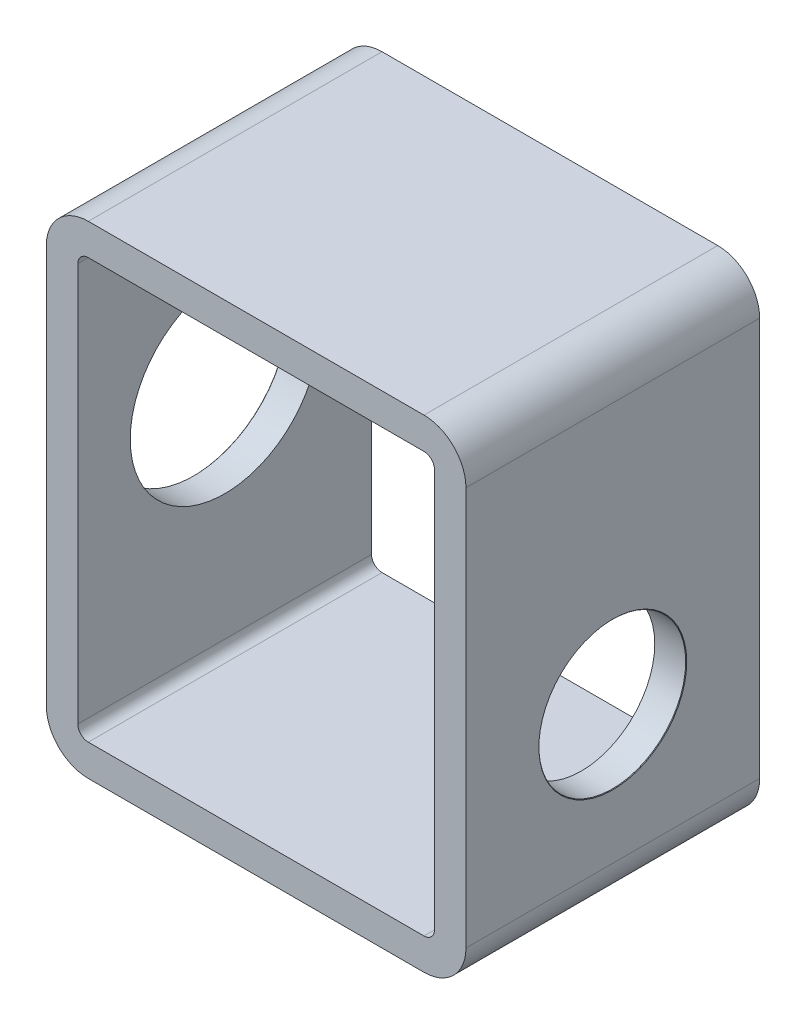
ISO-10303-21;
HEADER;
FILE_DESCRIPTION(('STEP AP214'),'2;1');
FILE_NAME('part.step','',(''),(''),'','','');
FILE_SCHEMA(('AUTOMOTIVE_DESIGN { 1 0 10303 214 1 1 1 1 }'));
ENDSEC;
DATA;
#1=APPLICATION_CONTEXT('core data for automotive mechanical design processes');
#2=APPLICATION_PROTOCOL_DEFINITION('international standard','automotive_design',2000,#1);
#3=PRODUCT_CONTEXT('',#1,'mechanical');
#4=PRODUCT('Part','Part','',(#3));
#5=PRODUCT_RELATED_PRODUCT_CATEGORY('part','',(#4));
#6=PRODUCT_DEFINITION_FORMATION('','',#4);
#7=PRODUCT_DEFINITION_CONTEXT('part definition',#1,'design');
#8=PRODUCT_DEFINITION('design','',#6,#7);
#9=PRODUCT_DEFINITION_SHAPE('','',#8);
#10=(LENGTH_UNIT() NAMED_UNIT(*) SI_UNIT(.MILLI.,.METRE.));
#11=(NAMED_UNIT(*) PLANE_ANGLE_UNIT() SI_UNIT($,.RADIAN.));
#12=(NAMED_UNIT(*) SI_UNIT($,.STERADIAN.) SOLID_ANGLE_UNIT());
#13=UNCERTAINTY_MEASURE_WITH_UNIT(LENGTH_MEASURE(1.E-05),#10,'distance_accuracy_value','');
#14=(GEOMETRIC_REPRESENTATION_CONTEXT(3) GLOBAL_UNCERTAINTY_ASSIGNED_CONTEXT((#13)) GLOBAL_UNIT_ASSIGNED_CONTEXT((#10,
#11,#12)) REPRESENTATION_CONTEXT('',''));
#15=CARTESIAN_POINT('',(0.,0.,0.));
#16=DIRECTION('',(0.,0.,1.));
#17=DIRECTION('',(1.,0.,0.));
#18=AXIS2_PLACEMENT_3D('',#15,#16,#17);
#19=CARTESIAN_POINT('',(0.,-0.5,14.));
#20=DIRECTION('',(-1.,0.,0.));
#21=DIRECTION('',(0.,-1.,0.));
#22=AXIS2_PLACEMENT_3D('',#19,#20,#21);
#23=PLANE('',#22);
#24=CARTESIAN_POINT('',(0.,-12.9456429809682,7.));
#25=DIRECTION('',(-1.,0.,0.));
#26=DIRECTION('',(0.,-1.,0.));
#27=AXIS2_PLACEMENT_3D('',#24,#25,#26);
#28=CIRCLE('',#27,3.5);
#29=CARTESIAN_POINT('',(0.,-16.4456429809682,7.));
#30=VERTEX_POINT('',#29);
#31=EDGE_CURVE('E86',#30,#30,#28,.T.);
#32=ORIENTED_EDGE('',*,*,#31,.F.);
#33=EDGE_LOOP('',(#32));
#34=FACE_BOUND('',#33,.T.);
#35=DIRECTION('',(0.,1.,0.));
#36=VECTOR('',#35,1.);
#37=CARTESIAN_POINT('',(0.,-0.5,0.));
#38=LINE('',#37,#36);
#39=CARTESIAN_POINT('',(0.,-19.5,0.));
#40=VERTEX_POINT('',#39);
#41=CARTESIAN_POINT('',(0.,-0.5,0.));
#42=VERTEX_POINT('',#41);
#43=EDGE_CURVE('E240',#40,#42,#38,.T.);
#44=ORIENTED_EDGE('',*,*,#43,.F.);
#45=DIRECTION('',(0.,0.,-1.));
#46=VECTOR('',#45,1.);
#47=CARTESIAN_POINT('',(0.,-19.5,14.));
#48=LINE('',#47,#46);
#49=CARTESIAN_POINT('',(0.,-19.5,14.));
#50=VERTEX_POINT('',#49);
#51=EDGE_CURVE('E262',#50,#40,#48,.T.);
#52=ORIENTED_EDGE('',*,*,#51,.F.);
#53=DIRECTION('',(0.,1.,0.));
#54=VECTOR('',#53,1.);
#55=CARTESIAN_POINT('',(0.,-0.5,14.));
#56=LINE('',#55,#54);
#57=CARTESIAN_POINT('',(0.,-0.5,14.));
#58=VERTEX_POINT('',#57);
#59=EDGE_CURVE('E221',#50,#58,#56,.T.);
#60=ORIENTED_EDGE('',*,*,#59,.T.);
#61=DIRECTION('',(0.,0.,-1.));
#62=VECTOR('',#61,1.);
#63=CARTESIAN_POINT('',(0.,-0.5,14.));
#64=LINE('',#63,#62);
#65=EDGE_CURVE('E260',#58,#42,#64,.T.);
#66=ORIENTED_EDGE('',*,*,#65,.T.);
#67=EDGE_LOOP('',(#44,#52,#60,#66));
#68=FACE_BOUND('',#67,.T.);
#69=ADVANCED_FACE('F82',(#34,#68),#23,.T.);
#70=CARTESIAN_POINT('',(-16.5,-19.5,14.));
#71=DIRECTION('',(0.,0.,-1.));
#72=DIRECTION('',(-1.,0.,0.));
#73=AXIS2_PLACEMENT_3D('',#70,#71,#72);
#74=PLANE('',#73);
#75=CARTESIAN_POINT('',(-16.5,-19.5,14.));
#76=DIRECTION('',(0.,0.,-1.));
#77=DIRECTION('',(-1.,0.,0.));
#78=AXIS2_PLACEMENT_3D('',#75,#76,#77);
#79=CIRCLE('',#78,2.);
#80=CARTESIAN_POINT('',(-18.5,-19.5,14.));
#81=VERTEX_POINT('',#80);
#82=CARTESIAN_POINT('',(-16.5,-21.5,14.));
#83=VERTEX_POINT('',#82);
#84=EDGE_CURVE('E265',#81,#83,#79,.F.);
#85=ORIENTED_EDGE('',*,*,#84,.T.);
#86=DIRECTION('',(1.,0.,0.));
#87=VECTOR('',#86,1.);
#88=CARTESIAN_POINT('',(-16.5,-21.5,14.));
#89=LINE('',#88,#87);
#90=CARTESIAN_POINT('',(-0.499999999999997,-21.5,14.));
#91=VERTEX_POINT('',#90);
#92=EDGE_CURVE('E268',#83,#91,#89,.T.);
#93=ORIENTED_EDGE('',*,*,#92,.T.);
#94=CARTESIAN_POINT('',(-0.499999999999998,-19.5,14.));
#95=DIRECTION('',(0.,0.,-1.));
#96=DIRECTION('',(-1.,0.,0.));
#97=AXIS2_PLACEMENT_3D('',#94,#95,#96);
#98=CIRCLE('',#97,2.);
#99=CARTESIAN_POINT('',(1.5,-19.5,14.));
#100=VERTEX_POINT('',#99);
#101=EDGE_CURVE('E271',#91,#100,#98,.F.);
#102=ORIENTED_EDGE('',*,*,#101,.T.);
#103=DIRECTION('',(0.,1.,0.));
#104=VECTOR('',#103,1.);
#105=CARTESIAN_POINT('',(1.5,-19.5,14.));
#106=LINE('',#105,#104);
#107=CARTESIAN_POINT('',(1.5,-0.5,14.));
#108=VERTEX_POINT('',#107);
#109=EDGE_CURVE('E273',#100,#108,#106,.T.);
#110=ORIENTED_EDGE('',*,*,#109,.T.);
#111=CARTESIAN_POINT('',(-0.5,-0.5,14.));
#112=DIRECTION('',(0.,0.,-1.));
#113=DIRECTION('',(-1.,0.,0.));
#114=AXIS2_PLACEMENT_3D('',#111,#112,#113);
#115=CIRCLE('',#114,2.);
#116=CARTESIAN_POINT('',(-0.500000000000001,1.5,14.));
#117=VERTEX_POINT('',#116);
#118=EDGE_CURVE('E275',#108,#117,#115,.F.);
#119=ORIENTED_EDGE('',*,*,#118,.T.);
#120=DIRECTION('',(-1.,0.,0.));
#121=VECTOR('',#120,1.);
#122=CARTESIAN_POINT('',(-16.5,1.5,14.));
#123=LINE('',#122,#121);
#124=CARTESIAN_POINT('',(-16.5,1.5,14.));
#125=VERTEX_POINT('',#124);
#126=EDGE_CURVE('E277',#117,#125,#123,.T.);
#127=ORIENTED_EDGE('',*,*,#126,.T.);
#128=CARTESIAN_POINT('',(-16.5,-0.500000000000003,14.));
#129=DIRECTION('',(0.,0.,-1.));
#130=DIRECTION('',(-1.,0.,0.));
#131=AXIS2_PLACEMENT_3D('',#128,#129,#130);
#132=CIRCLE('',#131,2.);
#133=CARTESIAN_POINT('',(-18.5,-0.500000000000003,14.));
#134=VERTEX_POINT('',#133);
#135=EDGE_CURVE('E279',#125,#134,#132,.F.);
#136=ORIENTED_EDGE('',*,*,#135,.T.);
#137=DIRECTION('',(0.,-1.,0.));
#138=VECTOR('',#137,1.);
#139=CARTESIAN_POINT('',(-18.5,-19.5,14.));
#140=LINE('',#139,#138);
#141=EDGE_CURVE('E281',#134,#81,#140,.T.);
#142=ORIENTED_EDGE('',*,*,#141,.T.);
#143=EDGE_LOOP('',(#85,#93,#102,#110,#119,#127,#136,#142));
#144=FACE_BOUND('',#143,.T.);
#145=CARTESIAN_POINT('',(-16.5,-19.5,14.));
#146=DIRECTION('',(0.,0.,1.));
#147=DIRECTION('',(-1.,0.,0.));
#148=AXIS2_PLACEMENT_3D('',#145,#146,#147);
#149=CIRCLE('',#148,0.500000000000004);
#150=CARTESIAN_POINT('',(-17.,-19.5,14.));
#151=VERTEX_POINT('',#150);
#152=CARTESIAN_POINT('',(-16.5,-20.,14.));
#153=VERTEX_POINT('',#152);
#154=EDGE_CURVE('E197',#151,#153,#149,.T.);
#155=ORIENTED_EDGE('',*,*,#154,.F.);
#156=DIRECTION('',(0.,-1.,0.));
#157=VECTOR('',#156,1.);
#158=CARTESIAN_POINT('',(-17.,-19.5,14.));
#159=LINE('',#158,#157);
#160=CARTESIAN_POINT('',(-17.,-0.500000000000004,14.));
#161=VERTEX_POINT('',#160);
#162=EDGE_CURVE('E232',#161,#151,#159,.T.);
#163=ORIENTED_EDGE('',*,*,#162,.F.);
#164=CARTESIAN_POINT('',(-16.5,-0.500000000000003,14.));
#165=DIRECTION('',(0.,0.,1.));
#166=DIRECTION('',(-1.,0.,0.));
#167=AXIS2_PLACEMENT_3D('',#164,#165,#166);
#168=CIRCLE('',#167,0.500000000000002);
#169=CARTESIAN_POINT('',(-16.5,0.,14.));
#170=VERTEX_POINT('',#169);
#171=EDGE_CURVE('E230',#170,#161,#168,.T.);
#172=ORIENTED_EDGE('',*,*,#171,.F.);
#173=DIRECTION('',(-1.,0.,0.));
#174=VECTOR('',#173,1.);
#175=CARTESIAN_POINT('',(-0.5,0.,14.));
#176=LINE('',#175,#174);
#177=CARTESIAN_POINT('',(-0.5,0.,14.));
#178=VERTEX_POINT('',#177);
#179=EDGE_CURVE('E228',#178,#170,#176,.T.);
#180=ORIENTED_EDGE('',*,*,#179,.F.);
#181=CARTESIAN_POINT('',(-0.5,-0.5,14.));
#182=DIRECTION('',(0.,0.,1.));
#183=DIRECTION('',(1.,0.,0.));
#184=AXIS2_PLACEMENT_3D('',#181,#182,#183);
#185=CIRCLE('',#184,0.5);
#186=EDGE_CURVE('E226',#58,#178,#185,.T.);
#187=ORIENTED_EDGE('',*,*,#186,.F.);
#188=ORIENTED_EDGE('',*,*,#59,.F.);
#189=CARTESIAN_POINT('',(-0.499999999999998,-19.5,14.));
#190=DIRECTION('',(0.,0.,1.));
#191=DIRECTION('',(-1.,0.,0.));
#192=AXIS2_PLACEMENT_3D('',#189,#190,#191);
#193=CIRCLE('',#192,0.499999999999999);
#194=CARTESIAN_POINT('',(-0.499999999999998,-20.,14.));
#195=VERTEX_POINT('',#194);
#196=EDGE_CURVE('E219',#195,#50,#193,.T.);
#197=ORIENTED_EDGE('',*,*,#196,.F.);
#198=DIRECTION('',(1.,0.,0.));
#199=VECTOR('',#198,1.);
#200=CARTESIAN_POINT('',(-0.499999999999998,-20.,14.));
#201=LINE('',#200,#199);
#202=EDGE_CURVE('E205',#153,#195,#201,.T.);
#203=ORIENTED_EDGE('',*,*,#202,.F.);
#204=EDGE_LOOP('',(#155,#163,#172,#180,#187,#188,#197,#203));
#205=FACE_BOUND('',#204,.T.);
#206=ADVANCED_FACE('F217',(#144,#205),#74,.F.);
#207=CARTESIAN_POINT('',(-16.5,-19.5,0.));
#208=DIRECTION('',(0.,0.,-1.));
#209=DIRECTION('',(-1.,0.,0.));
#210=AXIS2_PLACEMENT_3D('',#207,#208,#209);
#211=PLANE('',#210);
#212=CARTESIAN_POINT('',(-16.5,-19.5,0.));
#213=DIRECTION('',(0.,0.,-1.));
#214=DIRECTION('',(-1.,0.,0.));
#215=AXIS2_PLACEMENT_3D('',#212,#213,#214);
#216=CIRCLE('',#215,2.);
#217=CARTESIAN_POINT('',(-18.5,-19.5,0.));
#218=VERTEX_POINT('',#217);
#219=CARTESIAN_POINT('',(-16.5,-21.5,0.));
#220=VERTEX_POINT('',#219);
#221=EDGE_CURVE('E213',#218,#220,#216,.F.);
#222=ORIENTED_EDGE('',*,*,#221,.F.);
#223=DIRECTION('',(0.,-1.,0.));
#224=VECTOR('',#223,1.);
#225=CARTESIAN_POINT('',(-18.5,-19.5,0.));
#226=LINE('',#225,#224);
#227=CARTESIAN_POINT('',(-18.5,-0.500000000000003,0.));
#228=VERTEX_POINT('',#227);
#229=EDGE_CURVE('E269',#228,#218,#226,.T.);
#230=ORIENTED_EDGE('',*,*,#229,.F.);
#231=CARTESIAN_POINT('',(-16.5,-0.500000000000003,0.));
#232=DIRECTION('',(0.,0.,-1.));
#233=DIRECTION('',(-1.,0.,0.));
#234=AXIS2_PLACEMENT_3D('',#231,#232,#233);
#235=CIRCLE('',#234,2.);
#236=CARTESIAN_POINT('',(-16.5,1.5,0.));
#237=VERTEX_POINT('',#236);
#238=EDGE_CURVE('E296',#237,#228,#235,.F.);
#239=ORIENTED_EDGE('',*,*,#238,.F.);
#240=DIRECTION('',(-1.,0.,0.));
#241=VECTOR('',#240,1.);
#242=CARTESIAN_POINT('',(-16.5,1.5,0.));
#243=LINE('',#242,#241);
#244=CARTESIAN_POINT('',(-0.500000000000001,1.5,0.));
#245=VERTEX_POINT('',#244);
#246=EDGE_CURVE('E294',#245,#237,#243,.T.);
#247=ORIENTED_EDGE('',*,*,#246,.F.);
#248=CARTESIAN_POINT('',(-0.5,-0.5,0.));
#249=DIRECTION('',(0.,0.,-1.));
#250=DIRECTION('',(-1.,0.,0.));
#251=AXIS2_PLACEMENT_3D('',#248,#249,#250);
#252=CIRCLE('',#251,2.);
#253=CARTESIAN_POINT('',(1.5,-0.5,0.));
#254=VERTEX_POINT('',#253);
#255=EDGE_CURVE('E292',#254,#245,#252,.F.);
#256=ORIENTED_EDGE('',*,*,#255,.F.);
#257=DIRECTION('',(0.,1.,0.));
#258=VECTOR('',#257,1.);
#259=CARTESIAN_POINT('',(1.5,-19.5,0.));
#260=LINE('',#259,#258);
#261=CARTESIAN_POINT('',(1.5,-19.5,0.));
#262=VERTEX_POINT('',#261);
#263=EDGE_CURVE('E290',#262,#254,#260,.T.);
#264=ORIENTED_EDGE('',*,*,#263,.F.);
#265=CARTESIAN_POINT('',(-0.499999999999998,-19.5,0.));
#266=DIRECTION('',(0.,0.,-1.));
#267=DIRECTION('',(-1.,0.,0.));
#268=AXIS2_PLACEMENT_3D('',#265,#266,#267);
#269=CIRCLE('',#268,2.);
#270=CARTESIAN_POINT('',(-0.499999999999997,-21.5,0.));
#271=VERTEX_POINT('',#270);
#272=EDGE_CURVE('E288',#271,#262,#269,.F.);
#273=ORIENTED_EDGE('',*,*,#272,.F.);
#274=DIRECTION('',(1.,0.,0.));
#275=VECTOR('',#274,1.);
#276=CARTESIAN_POINT('',(-16.5,-21.5,0.));
#277=LINE('',#276,#275);
#278=EDGE_CURVE('E286',#220,#271,#277,.T.);
#279=ORIENTED_EDGE('',*,*,#278,.F.);
#280=EDGE_LOOP('',(#222,#230,#239,#247,#256,#264,#273,#279));
#281=FACE_BOUND('',#280,.T.);
#282=DIRECTION('',(0.,-1.,0.));
#283=VECTOR('',#282,1.);
#284=CARTESIAN_POINT('',(-17.,-19.5,0.));
#285=LINE('',#284,#283);
#286=CARTESIAN_POINT('',(-17.,-0.500000000000003,0.));
#287=VERTEX_POINT('',#286);
#288=CARTESIAN_POINT('',(-17.,-19.5,0.));
#289=VERTEX_POINT('',#288);
#290=EDGE_CURVE('E206',#287,#289,#285,.T.);
#291=ORIENTED_EDGE('',*,*,#290,.T.);
#292=CARTESIAN_POINT('',(-16.5,-19.5,0.));
#293=DIRECTION('',(0.,0.,1.));
#294=DIRECTION('',(-1.,0.,0.));
#295=AXIS2_PLACEMENT_3D('',#292,#293,#294);
#296=CIRCLE('',#295,0.500000000000004);
#297=CARTESIAN_POINT('',(-16.5,-20.,0.));
#298=VERTEX_POINT('',#297);
#299=EDGE_CURVE('E107',#289,#298,#296,.T.);
#300=ORIENTED_EDGE('',*,*,#299,.T.);
#301=DIRECTION('',(1.,0.,0.));
#302=VECTOR('',#301,1.);
#303=CARTESIAN_POINT('',(-0.499999999999998,-20.,0.));
#304=LINE('',#303,#302);
#305=CARTESIAN_POINT('',(-0.499999999999998,-20.,0.));
#306=VERTEX_POINT('',#305);
#307=EDGE_CURVE('E212',#298,#306,#304,.T.);
#308=ORIENTED_EDGE('',*,*,#307,.T.);
#309=CARTESIAN_POINT('',(-0.499999999999998,-19.5,0.));
#310=DIRECTION('',(0.,0.,1.));
#311=DIRECTION('',(-1.,0.,0.));
#312=AXIS2_PLACEMENT_3D('',#309,#310,#311);
#313=CIRCLE('',#312,0.499999999999999);
#314=EDGE_CURVE('E237',#306,#40,#313,.T.);
#315=ORIENTED_EDGE('',*,*,#314,.T.);
#316=ORIENTED_EDGE('',*,*,#43,.T.);
#317=CARTESIAN_POINT('',(-0.5,-0.5,0.));
#318=DIRECTION('',(0.,0.,1.));
#319=DIRECTION('',(1.,0.,0.));
#320=AXIS2_PLACEMENT_3D('',#317,#318,#319);
#321=CIRCLE('',#320,0.5);
#322=CARTESIAN_POINT('',(-0.5,0.,0.));
#323=VERTEX_POINT('',#322);
#324=EDGE_CURVE('E243',#42,#323,#321,.T.);
#325=ORIENTED_EDGE('',*,*,#324,.T.);
#326=DIRECTION('',(-1.,0.,0.));
#327=VECTOR('',#326,1.);
#328=CARTESIAN_POINT('',(-0.5,0.,0.));
#329=LINE('',#328,#327);
#330=CARTESIAN_POINT('',(-16.5,0.,0.));
#331=VERTEX_POINT('',#330);
#332=EDGE_CURVE('E246',#323,#331,#329,.T.);
#333=ORIENTED_EDGE('',*,*,#332,.T.);
#334=CARTESIAN_POINT('',(-16.5,-0.500000000000003,0.));
#335=DIRECTION('',(0.,0.,1.));
#336=DIRECTION('',(-1.,0.,0.));
#337=AXIS2_PLACEMENT_3D('',#334,#335,#336);
#338=CIRCLE('',#337,0.500000000000002);
#339=EDGE_CURVE('E249',#331,#287,#338,.T.);
#340=ORIENTED_EDGE('',*,*,#339,.T.);
#341=EDGE_LOOP('',(#291,#300,#308,#315,#316,#325,#333,#340));
#342=FACE_BOUND('',#341,.T.);
#343=ADVANCED_FACE('F355',(#281,#342),#211,.T.);
#344=CARTESIAN_POINT('',(-16.5,-19.5,14.));
#345=DIRECTION('',(0.,0.,-1.));
#346=DIRECTION('',(-1.,0.,0.));
#347=AXIS2_PLACEMENT_3D('',#344,#345,#346);
#348=CYLINDRICAL_SURFACE('',#347,2.);
#349=ORIENTED_EDGE('',*,*,#221,.T.);
#350=DIRECTION('',(0.,0.,-1.));
#351=VECTOR('',#350,1.);
#352=CARTESIAN_POINT('',(-16.5,-21.5,14.));
#353=LINE('',#352,#351);
#354=EDGE_CURVE('E12',#83,#220,#353,.T.);
#355=ORIENTED_EDGE('',*,*,#354,.F.);
#356=ORIENTED_EDGE('',*,*,#84,.F.);
#357=DIRECTION('',(0.,0.,-1.));
#358=VECTOR('',#357,1.);
#359=CARTESIAN_POINT('',(-18.5,-19.5,14.));
#360=LINE('',#359,#358);
#361=EDGE_CURVE('E283',#81,#218,#360,.T.);
#362=ORIENTED_EDGE('',*,*,#361,.T.);
#363=EDGE_LOOP('',(#349,#355,#356,#362));
#364=FACE_BOUND('',#363,.T.);
#365=ADVANCED_FACE('F84',(#364),#348,.T.);
#366=CARTESIAN_POINT('',(-16.5,-21.5,14.));
#367=DIRECTION('',(0.,1.,0.));
#368=DIRECTION('',(-1.,0.,0.));
#369=AXIS2_PLACEMENT_3D('',#366,#367,#368);
#370=PLANE('',#369);
#371=ORIENTED_EDGE('',*,*,#278,.T.);
#372=DIRECTION('',(0.,0.,-1.));
#373=VECTOR('',#372,1.);
#374=CARTESIAN_POINT('',(-0.499999999999997,-21.5,14.));
#375=LINE('',#374,#373);
#376=EDGE_CURVE('E91',#91,#271,#375,.T.);
#377=ORIENTED_EDGE('',*,*,#376,.F.);
#378=ORIENTED_EDGE('',*,*,#92,.F.);
#379=ORIENTED_EDGE('',*,*,#354,.T.);
#380=EDGE_LOOP('',(#371,#377,#378,#379));
#381=FACE_BOUND('',#380,.T.);
#382=ADVANCED_FACE('F375',(#381),#370,.F.);
#383=CARTESIAN_POINT('',(-0.499999999999998,-19.5,14.));
#384=DIRECTION('',(0.,0.,-1.));
#385=DIRECTION('',(-1.,0.,0.));
#386=AXIS2_PLACEMENT_3D('',#383,#384,#385);
#387=CYLINDRICAL_SURFACE('',#386,2.);
#388=ORIENTED_EDGE('',*,*,#272,.T.);
#389=DIRECTION('',(0.,0.,-1.));
#390=VECTOR('',#389,1.);
#391=CARTESIAN_POINT('',(1.5,-19.5,14.));
#392=LINE('',#391,#390);
#393=EDGE_CURVE('E313',#100,#262,#392,.T.);
#394=ORIENTED_EDGE('',*,*,#393,.F.);
#395=ORIENTED_EDGE('',*,*,#101,.F.);
#396=ORIENTED_EDGE('',*,*,#376,.T.);
#397=EDGE_LOOP('',(#388,#394,#395,#396));
#398=FACE_BOUND('',#397,.T.);
#399=ADVANCED_FACE('F341',(#398),#387,.T.);
#400=CARTESIAN_POINT('',(1.5,-19.5,14.));
#401=DIRECTION('',(-1.,0.,0.));
#402=DIRECTION('',(0.,-1.,0.));
#403=AXIS2_PLACEMENT_3D('',#400,#401,#402);
#404=PLANE('',#403);
#405=CARTESIAN_POINT('',(1.5,-12.9456429809682,7.));
#406=DIRECTION('',(1.,0.,0.));
#407=DIRECTION('',(0.,0.,-1.));
#408=AXIS2_PLACEMENT_3D('',#405,#406,#407);
#409=CIRCLE('',#408,3.525);
#410=CARTESIAN_POINT('',(1.5,-12.9456429809682,3.475));
#411=VERTEX_POINT('',#410);
#412=EDGE_CURVE('E331',#411,#411,#409,.T.);
#413=ORIENTED_EDGE('',*,*,#412,.F.);
#414=EDGE_LOOP('',(#413));
#415=FACE_BOUND('',#414,.T.);
#416=ORIENTED_EDGE('',*,*,#263,.T.);
#417=DIRECTION('',(0.,0.,-1.));
#418=VECTOR('',#417,1.);
#419=CARTESIAN_POINT('',(1.5,-0.5,14.));
#420=LINE('',#419,#418);
#421=EDGE_CURVE('E310',#108,#254,#420,.T.);
#422=ORIENTED_EDGE('',*,*,#421,.F.);
#423=ORIENTED_EDGE('',*,*,#109,.F.);
#424=ORIENTED_EDGE('',*,*,#393,.T.);
#425=EDGE_LOOP('',(#416,#422,#423,#424));
#426=FACE_BOUND('',#425,.T.);
#427=ADVANCED_FACE('F337',(#415,#426),#404,.F.);
#428=CARTESIAN_POINT('',(-0.5,-0.5,14.));
#429=DIRECTION('',(0.,0.,-1.));
#430=DIRECTION('',(-1.,0.,0.));
#431=AXIS2_PLACEMENT_3D('',#428,#429,#430);
#432=CYLINDRICAL_SURFACE('',#431,2.);
#433=ORIENTED_EDGE('',*,*,#255,.T.);
#434=DIRECTION('',(0.,0.,-1.));
#435=VECTOR('',#434,1.);
#436=CARTESIAN_POINT('',(-0.500000000000001,1.5,14.));
#437=LINE('',#436,#435);
#438=EDGE_CURVE('E307',#117,#245,#437,.T.);
#439=ORIENTED_EDGE('',*,*,#438,.F.);
#440=ORIENTED_EDGE('',*,*,#118,.F.);
#441=ORIENTED_EDGE('',*,*,#421,.T.);
#442=EDGE_LOOP('',(#433,#439,#440,#441));
#443=FACE_BOUND('',#442,.T.);
#444=ADVANCED_FACE('F340',(#443),#432,.T.);
#445=CARTESIAN_POINT('',(-16.5,1.5,14.));
#446=DIRECTION('',(0.,-1.,0.));
#447=DIRECTION('',(1.,0.,0.));
#448=AXIS2_PLACEMENT_3D('',#445,#446,#447);
#449=PLANE('',#448);
#450=ORIENTED_EDGE('',*,*,#246,.T.);
#451=DIRECTION('',(0.,0.,-1.));
#452=VECTOR('',#451,1.);
#453=CARTESIAN_POINT('',(-16.5,1.5,14.));
#454=LINE('',#453,#452);
#455=EDGE_CURVE('E304',#125,#237,#454,.T.);
#456=ORIENTED_EDGE('',*,*,#455,.F.);
#457=ORIENTED_EDGE('',*,*,#126,.F.);
#458=ORIENTED_EDGE('',*,*,#438,.T.);
#459=EDGE_LOOP('',(#450,#456,#457,#458));
#460=FACE_BOUND('',#459,.T.);
#461=ADVANCED_FACE('F361',(#460),#449,.F.);
#462=CARTESIAN_POINT('',(-16.5,-0.500000000000003,14.));
#463=DIRECTION('',(0.,0.,-1.));
#464=DIRECTION('',(-1.,0.,0.));
#465=AXIS2_PLACEMENT_3D('',#462,#463,#464);
#466=CYLINDRICAL_SURFACE('',#465,2.);
#467=ORIENTED_EDGE('',*,*,#238,.T.);
#468=DIRECTION('',(0.,0.,-1.));
#469=VECTOR('',#468,1.);
#470=CARTESIAN_POINT('',(-18.5,-0.500000000000003,14.));
#471=LINE('',#470,#469);
#472=EDGE_CURVE('E301',#134,#228,#471,.T.);
#473=ORIENTED_EDGE('',*,*,#472,.F.);
#474=ORIENTED_EDGE('',*,*,#135,.F.);
#475=ORIENTED_EDGE('',*,*,#455,.T.);
#476=EDGE_LOOP('',(#467,#473,#474,#475));
#477=FACE_BOUND('',#476,.T.);
#478=ADVANCED_FACE('F365',(#477),#466,.T.);
#479=CARTESIAN_POINT('',(-18.5,-19.5,14.));
#480=DIRECTION('',(1.,0.,0.));
#481=DIRECTION('',(0.,0.,-1.));
#482=AXIS2_PLACEMENT_3D('',#479,#480,#481);
#483=PLANE('',#482);
#484=CARTESIAN_POINT('',(-18.5,-9.00000000000002,7.));
#485=DIRECTION('',(-1.,0.,0.));
#486=DIRECTION('',(0.,0.,1.));
#487=AXIS2_PLACEMENT_3D('',#484,#485,#486);
#488=CIRCLE('',#487,4.525);
#489=CARTESIAN_POINT('',(-18.5,-9.00000000000002,11.525));
#490=VERTEX_POINT('',#489);
#491=EDGE_CURVE('E322',#490,#490,#488,.T.);
#492=ORIENTED_EDGE('',*,*,#491,.F.);
#493=EDGE_LOOP('',(#492));
#494=FACE_BOUND('',#493,.T.);
#495=ORIENTED_EDGE('',*,*,#229,.T.);
#496=ORIENTED_EDGE('',*,*,#361,.F.);
#497=ORIENTED_EDGE('',*,*,#141,.F.);
#498=ORIENTED_EDGE('',*,*,#472,.T.);
#499=EDGE_LOOP('',(#495,#496,#497,#498));
#500=FACE_BOUND('',#499,.T.);
#501=ADVANCED_FACE('F379',(#494,#500),#483,.F.);
#502=CARTESIAN_POINT('',(-16.5,-19.5,14.));
#503=DIRECTION('',(0.,0.,-1.));
#504=DIRECTION('',(-1.,0.,0.));
#505=AXIS2_PLACEMENT_3D('',#502,#503,#504);
#506=CYLINDRICAL_SURFACE('',#505,0.500000000000004);
#507=ORIENTED_EDGE('',*,*,#299,.F.);
#508=DIRECTION('',(0.,0.,-1.));
#509=VECTOR('',#508,1.);
#510=CARTESIAN_POINT('',(-17.,-19.5,14.));
#511=LINE('',#510,#509);
#512=EDGE_CURVE('E201',#151,#289,#511,.T.);
#513=ORIENTED_EDGE('',*,*,#512,.F.);
#514=ORIENTED_EDGE('',*,*,#154,.T.);
#515=DIRECTION('',(0.,0.,-1.));
#516=VECTOR('',#515,1.);
#517=CARTESIAN_POINT('',(-16.5,-20.,14.));
#518=LINE('',#517,#516);
#519=EDGE_CURVE('E200',#153,#298,#518,.T.);
#520=ORIENTED_EDGE('',*,*,#519,.T.);
#521=EDGE_LOOP('',(#507,#513,#514,#520));
#522=FACE_BOUND('',#521,.T.);
#523=ADVANCED_FACE('F199',(#522),#506,.F.);
#524=CARTESIAN_POINT('',(-0.499999999999998,-20.,14.));
#525=DIRECTION('',(0.,1.,0.));
#526=DIRECTION('',(-1.,0.,0.));
#527=AXIS2_PLACEMENT_3D('',#524,#525,#526);
#528=PLANE('',#527);
#529=ORIENTED_EDGE('',*,*,#307,.F.);
#530=ORIENTED_EDGE('',*,*,#519,.F.);
#531=ORIENTED_EDGE('',*,*,#202,.T.);
#532=DIRECTION('',(0.,0.,-1.));
#533=VECTOR('',#532,1.);
#534=CARTESIAN_POINT('',(-0.499999999999998,-20.,14.));
#535=LINE('',#534,#533);
#536=EDGE_CURVE('E214',#195,#306,#535,.T.);
#537=ORIENTED_EDGE('',*,*,#536,.T.);
#538=EDGE_LOOP('',(#529,#530,#531,#537));
#539=FACE_BOUND('',#538,.T.);
#540=ADVANCED_FACE('F209',(#539),#528,.T.);
#541=CARTESIAN_POINT('',(-0.499999999999998,-19.5,14.));
#542=DIRECTION('',(0.,0.,-1.));
#543=DIRECTION('',(-1.,0.,0.));
#544=AXIS2_PLACEMENT_3D('',#541,#542,#543);
#545=CYLINDRICAL_SURFACE('',#544,0.499999999999999);
#546=ORIENTED_EDGE('',*,*,#314,.F.);
#547=ORIENTED_EDGE('',*,*,#536,.F.);
#548=ORIENTED_EDGE('',*,*,#196,.T.);
#549=ORIENTED_EDGE('',*,*,#51,.T.);
#550=EDGE_LOOP('',(#546,#547,#548,#549));
#551=FACE_BOUND('',#550,.T.);
#552=ADVANCED_FACE('F404',(#551),#545,.F.);
#553=CARTESIAN_POINT('',(-0.5,-0.5,14.));
#554=DIRECTION('',(0.,0.,-1.));
#555=DIRECTION('',(-1.,0.,0.));
#556=AXIS2_PLACEMENT_3D('',#553,#554,#555);
#557=CYLINDRICAL_SURFACE('',#556,0.5);
#558=ORIENTED_EDGE('',*,*,#324,.F.);
#559=ORIENTED_EDGE('',*,*,#65,.F.);
#560=ORIENTED_EDGE('',*,*,#186,.T.);
#561=DIRECTION('',(0.,0.,-1.));
#562=VECTOR('',#561,1.);
#563=CARTESIAN_POINT('',(-0.5,0.,14.));
#564=LINE('',#563,#562);
#565=EDGE_CURVE('E258',#178,#323,#564,.T.);
#566=ORIENTED_EDGE('',*,*,#565,.T.);
#567=EDGE_LOOP('',(#558,#559,#560,#566));
#568=FACE_BOUND('',#567,.T.);
#569=ADVANCED_FACE('F402',(#568),#557,.F.);
#570=CARTESIAN_POINT('',(-0.5,0.,14.));
#571=DIRECTION('',(0.,-1.,0.));
#572=DIRECTION('',(1.,0.,0.));
#573=AXIS2_PLACEMENT_3D('',#570,#571,#572);
#574=PLANE('',#573);
#575=ORIENTED_EDGE('',*,*,#332,.F.);
#576=ORIENTED_EDGE('',*,*,#565,.F.);
#577=ORIENTED_EDGE('',*,*,#179,.T.);
#578=DIRECTION('',(0.,0.,-1.));
#579=VECTOR('',#578,1.);
#580=CARTESIAN_POINT('',(-16.5,0.,14.));
#581=LINE('',#580,#579);
#582=EDGE_CURVE('E256',#170,#331,#581,.T.);
#583=ORIENTED_EDGE('',*,*,#582,.T.);
#584=EDGE_LOOP('',(#575,#576,#577,#583));
#585=FACE_BOUND('',#584,.T.);
#586=ADVANCED_FACE('F460',(#585),#574,.T.);
#587=CARTESIAN_POINT('',(-16.5,-0.500000000000003,14.));
#588=DIRECTION('',(0.,0.,-1.));
#589=DIRECTION('',(-1.,0.,0.));
#590=AXIS2_PLACEMENT_3D('',#587,#588,#589);
#591=CYLINDRICAL_SURFACE('',#590,0.500000000000002);
#592=ORIENTED_EDGE('',*,*,#339,.F.);
#593=ORIENTED_EDGE('',*,*,#582,.F.);
#594=ORIENTED_EDGE('',*,*,#171,.T.);
#595=DIRECTION('',(0.,0.,-1.));
#596=VECTOR('',#595,1.);
#597=CARTESIAN_POINT('',(-17.,-0.500000000000003,14.));
#598=LINE('',#597,#596);
#599=EDGE_CURVE('E99',#161,#287,#598,.T.);
#600=ORIENTED_EDGE('',*,*,#599,.T.);
#601=EDGE_LOOP('',(#592,#593,#594,#600));
#602=FACE_BOUND('',#601,.T.);
#603=ADVANCED_FACE('F469',(#602),#591,.F.);
#604=CARTESIAN_POINT('',(-17.,-19.5,14.));
#605=DIRECTION('',(1.,0.,0.));
#606=DIRECTION('',(0.,0.,-1.));
#607=AXIS2_PLACEMENT_3D('',#604,#605,#606);
#608=PLANE('',#607);
#609=CARTESIAN_POINT('',(-17.,-9.00000000000002,7.));
#610=DIRECTION('',(1.,0.,0.));
#611=DIRECTION('',(0.,0.,-1.));
#612=AXIS2_PLACEMENT_3D('',#609,#610,#611);
#613=CIRCLE('',#612,4.49999999999999);
#614=CARTESIAN_POINT('',(-17.,-9.00000000000002,2.50000000000001));
#615=VERTEX_POINT('',#614);
#616=EDGE_CURVE('E235',#615,#615,#613,.T.);
#617=ORIENTED_EDGE('',*,*,#616,.F.);
#618=EDGE_LOOP('',(#617));
#619=FACE_BOUND('',#618,.T.);
#620=ORIENTED_EDGE('',*,*,#290,.F.);
#621=ORIENTED_EDGE('',*,*,#599,.F.);
#622=ORIENTED_EDGE('',*,*,#162,.T.);
#623=ORIENTED_EDGE('',*,*,#512,.T.);
#624=EDGE_LOOP('',(#620,#621,#622,#623));
#625=FACE_BOUND('',#624,.T.);
#626=ADVANCED_FACE('F477',(#619,#625),#608,.T.);
#627=CARTESIAN_POINT('',(-18.5,-9.00000000000002,7.));
#628=DIRECTION('',(-1.,0.,0.));
#629=DIRECTION('',(0.,0.,1.));
#630=AXIS2_PLACEMENT_3D('',#627,#628,#629);
#631=CYLINDRICAL_SURFACE('',#630,4.49999999999999);
#632=ORIENTED_EDGE('',*,*,#616,.T.);
#633=EDGE_LOOP('',(#632));
#634=FACE_BOUND('',#633,.T.);
#635=CARTESIAN_POINT('',(-18.475,-9.00000000000002,7.));
#636=DIRECTION('',(-1.,0.,0.));
#637=DIRECTION('',(0.,0.,1.));
#638=AXIS2_PLACEMENT_3D('',#635,#636,#637);
#639=CIRCLE('',#638,4.49999999999999);
#640=CARTESIAN_POINT('',(-18.475,-9.00000000000002,11.5));
#641=VERTEX_POINT('',#640);
#642=EDGE_CURVE('E318',#641,#641,#639,.T.);
#643=ORIENTED_EDGE('',*,*,#642,.T.);
#644=EDGE_LOOP('',(#643));
#645=FACE_BOUND('',#644,.T.);
#646=ADVANCED_FACE('F491',(#634,#645),#631,.F.);
#647=CARTESIAN_POINT('',(-18.5,-9.00000000000002,7.));
#648=DIRECTION('',(-1.,0.,0.));
#649=DIRECTION('',(0.,0.,1.));
#650=AXIS2_PLACEMENT_3D('',#647,#648,#649);
#651=CONICAL_SURFACE('',#650,4.525,0.785398163397518);
#652=ORIENTED_EDGE('',*,*,#642,.F.);
#653=EDGE_LOOP('',(#652));
#654=FACE_BOUND('',#653,.T.);
#655=ORIENTED_EDGE('',*,*,#491,.T.);
#656=EDGE_LOOP('',(#655));
#657=FACE_BOUND('',#656,.T.);
#658=ADVANCED_FACE('F501',(#654,#657),#651,.F.);
#659=CARTESIAN_POINT('',(1.5,-12.9456429809682,7.));
#660=DIRECTION('',(1.,0.,0.));
#661=DIRECTION('',(0.,0.,-1.));
#662=AXIS2_PLACEMENT_3D('',#659,#660,#661);
#663=CYLINDRICAL_SURFACE('',#662,3.5);
#664=ORIENTED_EDGE('',*,*,#31,.T.);
#665=EDGE_LOOP('',(#664));
#666=FACE_BOUND('',#665,.T.);
#667=CARTESIAN_POINT('',(1.475,-12.9456429809682,7.));
#668=DIRECTION('',(1.,0.,0.));
#669=DIRECTION('',(0.,0.,-1.));
#670=AXIS2_PLACEMENT_3D('',#667,#668,#669);
#671=CIRCLE('',#670,3.5);
#672=CARTESIAN_POINT('',(1.475,-12.9456429809682,3.5));
#673=VERTEX_POINT('',#672);
#674=EDGE_CURVE('E328',#673,#673,#671,.T.);
#675=ORIENTED_EDGE('',*,*,#674,.T.);
#676=EDGE_LOOP('',(#675));
#677=FACE_BOUND('',#676,.T.);
#678=ADVANCED_FACE('F509',(#666,#677),#663,.F.);
#679=CARTESIAN_POINT('',(1.5,-12.9456429809682,7.));
#680=DIRECTION('',(1.,0.,0.));
#681=DIRECTION('',(0.,0.,-1.));
#682=AXIS2_PLACEMENT_3D('',#679,#680,#681);
#683=CONICAL_SURFACE('',#682,3.525,0.785398163397483);
#684=ORIENTED_EDGE('',*,*,#674,.F.);
#685=EDGE_LOOP('',(#684));
#686=FACE_BOUND('',#685,.T.);
#687=ORIENTED_EDGE('',*,*,#412,.T.);
#688=EDGE_LOOP('',(#687));
#689=FACE_BOUND('',#688,.T.);
#690=ADVANCED_FACE('F335',(#686,#689),#683,.F.);
#691=CLOSED_SHELL('',(#69,#206,#343,#365,#382,#399,#427,#444,#461,#478,#501,#523,#540,#552,#569,
#586,#603,#626,#646,#658,#678,#690));
#692=MANIFOLD_SOLID_BREP('B2',#691);
#693=ADVANCED_BREP_SHAPE_REPRESENTATION('',(#18,#692),#14);
#694=SHAPE_DEFINITION_REPRESENTATION(#9,#693);
ENDSEC;
END-ISO-10303-21;
